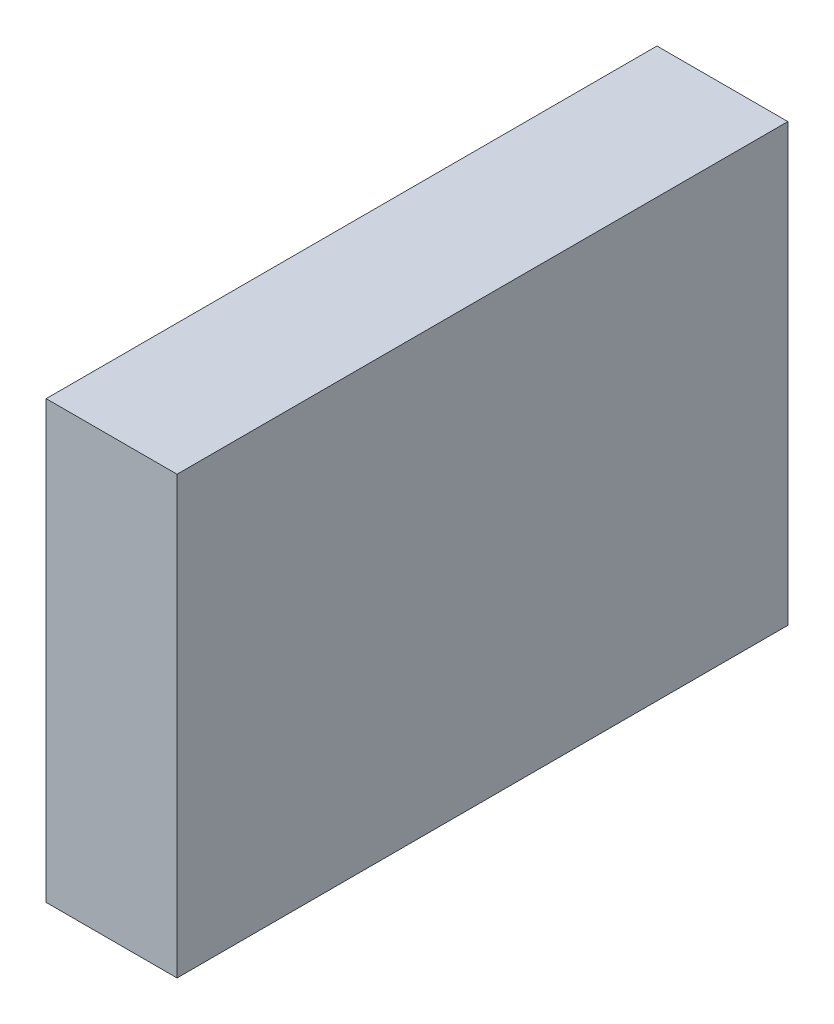
ISO-10303-21;
HEADER;
FILE_DESCRIPTION(('STEP AP214'),'2;1');
FILE_NAME('part.step','',(''),(''),'','','');
FILE_SCHEMA(('AUTOMOTIVE_DESIGN { 1 0 10303 214 1 1 1 1 }'));
ENDSEC;
DATA;
#1=APPLICATION_CONTEXT('core data for automotive mechanical design processes');
#2=APPLICATION_PROTOCOL_DEFINITION('international standard','automotive_design',2000,#1);
#3=PRODUCT_CONTEXT('',#1,'mechanical');
#4=PRODUCT('Part','Part','',(#3));
#5=PRODUCT_RELATED_PRODUCT_CATEGORY('part','',(#4));
#6=PRODUCT_DEFINITION_FORMATION('','',#4);
#7=PRODUCT_DEFINITION_CONTEXT('part definition',#1,'design');
#8=PRODUCT_DEFINITION('design','',#6,#7);
#9=PRODUCT_DEFINITION_SHAPE('','',#8);
#10=(LENGTH_UNIT() NAMED_UNIT(*) SI_UNIT(.MILLI.,.METRE.));
#11=(NAMED_UNIT(*) PLANE_ANGLE_UNIT() SI_UNIT($,.RADIAN.));
#12=(NAMED_UNIT(*) SI_UNIT($,.STERADIAN.) SOLID_ANGLE_UNIT());
#13=UNCERTAINTY_MEASURE_WITH_UNIT(LENGTH_MEASURE(1.E-05),#10,'distance_accuracy_value','');
#14=(GEOMETRIC_REPRESENTATION_CONTEXT(3) GLOBAL_UNCERTAINTY_ASSIGNED_CONTEXT((#13)) GLOBAL_UNIT_ASSIGNED_CONTEXT((#10,
#11,#12)) REPRESENTATION_CONTEXT('',''));
#15=CARTESIAN_POINT('',(0.,0.,0.));
#16=DIRECTION('',(0.,0.,1.));
#17=DIRECTION('',(1.,0.,0.));
#18=AXIS2_PLACEMENT_3D('',#15,#16,#17);
#19=CARTESIAN_POINT('',(3.00000011889495,0.679999297994104,-3.72112146154861));
#20=DIRECTION('',(1.,-1.74845553146952E-07,0.));
#21=DIRECTION('',(1.74845553146952E-07,1.,8.74227765734759E-08));
#22=AXIS2_PLACEMENT_3D('',#19,#20,#21);
#23=PLANE('',#22);
#24=DIRECTION('',(0.,8.74227765576152E-08,-0.999999999999996));
#25=VECTOR('',#24,1.);
#26=CARTESIAN_POINT('',(3.00000013113411,0.749999169481623,-2.25112145542901));
#27=LINE('',#26,#25);
#28=CARTESIAN_POINT('',(3.00000013113411,0.749999169481623,-2.25112145543001));
#29=VERTEX_POINT('',#28);
#30=CARTESIAN_POINT('',(3.00000013113413,0.74999929187451,-3.65112145542901));
#31=VERTEX_POINT('',#30);
#32=EDGE_CURVE('E11',#29,#31,#27,.T.);
#33=ORIENTED_EDGE('',*,*,#32,.F.);
#34=DIRECTION('',(-1.74845553146599E-07,-0.999999999999981,-8.74227765732993E-08));
#35=VECTOR('',#34,1.);
#36=CARTESIAN_POINT('',(3.00000030597966,1.74999916948362,-2.25112136800623));
#37=LINE('',#36,#35);
#38=CARTESIAN_POINT('',(3.00000030597966,1.74999916948262,-2.25112136800623));
#39=VERTEX_POINT('',#38);
#40=EDGE_CURVE('E59',#39,#29,#37,.T.);
#41=ORIENTED_EDGE('',*,*,#40,.F.);
#42=DIRECTION('',(0.,-8.74227766369168E-08,0.999999999999996));
#43=VECTOR('',#42,1.);
#44=CARTESIAN_POINT('',(3.00000030597969,1.74999929187551,-3.65112136800624));
#45=LINE('',#44,#43);
#46=CARTESIAN_POINT('',(3.00000030597969,1.74999929187551,-3.65112136800523));
#47=VERTEX_POINT('',#46);
#48=EDGE_CURVE('E79',#47,#39,#45,.T.);
#49=ORIENTED_EDGE('',*,*,#48,.F.);
#50=DIRECTION('',(1.74845553146599E-07,0.999999999999981,8.74227765732994E-08));
#51=VECTOR('',#50,1.);
#52=CARTESIAN_POINT('',(3.00000013113413,0.74999929187351,-3.65112145542901));
#53=LINE('',#52,#51);
#54=EDGE_CURVE('E84',#31,#47,#53,.T.);
#55=ORIENTED_EDGE('',*,*,#54,.F.);
#56=EDGE_LOOP('',(#33,#41,#49,#55));
#57=FACE_BOUND('',#56,.T.);
#58=ADVANCED_FACE('F17',(#57),#23,.F.);
#59=CARTESIAN_POINT('',(3.30000011889495,0.679999245540438,-3.72112146154861));
#60=DIRECTION('',(1.,-1.74845553146952E-07,0.));
#61=DIRECTION('',(1.74845553146952E-07,1.,8.74227765734759E-08));
#62=AXIS2_PLACEMENT_3D('',#59,#60,#61);
#63=PLANE('',#62);
#64=DIRECTION('',(1.74845553146599E-07,0.999999999999981,8.74227765732994E-08));
#65=VECTOR('',#64,1.);
#66=CARTESIAN_POINT('',(3.30000013113413,0.749999239419844,-3.65112145542901));
#67=LINE('',#66,#65);
#68=CARTESIAN_POINT('',(3.30000013113413,0.749999239420844,-3.65112145542901));
#69=VERTEX_POINT('',#68);
#70=CARTESIAN_POINT('',(3.30000030597969,1.74999923942184,-3.65112136800523));
#71=VERTEX_POINT('',#70);
#72=EDGE_CURVE('E24',#69,#71,#67,.T.);
#73=ORIENTED_EDGE('',*,*,#72,.T.);
#74=DIRECTION('',(0.,-8.74227764783136E-08,0.999999999999996));
#75=VECTOR('',#74,1.);
#76=CARTESIAN_POINT('',(3.30000030597969,1.74999923942184,-3.65112136800623));
#77=LINE('',#76,#75);
#78=CARTESIAN_POINT('',(3.30000030597966,1.74999911702896,-2.25112136800623));
#79=VERTEX_POINT('',#78);
#80=EDGE_CURVE('E82',#71,#79,#77,.T.);
#81=ORIENTED_EDGE('',*,*,#80,.T.);
#82=DIRECTION('',(-1.74845553146599E-07,-0.999999999999981,-8.74227765732993E-08));
#83=VECTOR('',#82,1.);
#84=CARTESIAN_POINT('',(3.30000030597966,1.74999911702996,-2.25112136800623));
#85=LINE('',#84,#83);
#86=CARTESIAN_POINT('',(3.30000013113411,0.749999117027957,-2.25112145543001));
#87=VERTEX_POINT('',#86);
#88=EDGE_CURVE('E64',#79,#87,#85,.T.);
#89=ORIENTED_EDGE('',*,*,#88,.T.);
#90=DIRECTION('',(0.,8.74227765576152E-08,-0.999999999999996));
#91=VECTOR('',#90,1.);
#92=CARTESIAN_POINT('',(3.30000013113411,0.749999117027957,-2.25112145542901));
#93=LINE('',#92,#91);
#94=EDGE_CURVE('E61',#87,#69,#93,.T.);
#95=ORIENTED_EDGE('',*,*,#94,.T.);
#96=EDGE_LOOP('',(#73,#81,#89,#95));
#97=FACE_BOUND('',#96,.T.);
#98=ADVANCED_FACE('F62',(#97),#63,.T.);
#99=CARTESIAN_POINT('',(3.00000013113413,0.74999929187351,-3.65112145542901));
#100=DIRECTION('',(0.,8.74227765734759E-08,-1.));
#101=DIRECTION('',(1.74845553146952E-07,1.,8.74227765734759E-08));
#102=AXIS2_PLACEMENT_3D('',#99,#100,#101);
#103=PLANE('',#102);
#104=ORIENTED_EDGE('',*,*,#54,.T.);
#105=DIRECTION('',(0.999999999999985,-1.7484555285089E-07,0.));
#106=VECTOR('',#105,1.);
#107=CARTESIAN_POINT('',(3.00000030597969,1.74999929187551,-3.65112136800623));
#108=LINE('',#107,#106);
#109=EDGE_CURVE('E57',#47,#71,#108,.T.);
#110=ORIENTED_EDGE('',*,*,#109,.T.);
#111=ORIENTED_EDGE('',*,*,#72,.F.);
#112=DIRECTION('',(0.999999999999985,-1.74845553220964E-07,0.));
#113=VECTOR('',#112,1.);
#114=CARTESIAN_POINT('',(3.00000013113413,0.74999929187351,-3.65112145542901));
#115=LINE('',#114,#113);
#116=EDGE_CURVE('E55',#31,#69,#115,.T.);
#117=ORIENTED_EDGE('',*,*,#116,.F.);
#118=EDGE_LOOP('',(#104,#110,#111,#117));
#119=FACE_BOUND('',#118,.T.);
#120=ADVANCED_FACE('F53',(#119),#103,.T.);
#121=CARTESIAN_POINT('',(3.00000030597969,1.74999929187551,-3.65112136800623));
#122=DIRECTION('',(1.74845553146952E-07,1.,8.74227765734759E-08));
#123=DIRECTION('',(0.,-8.74227765734759E-08,1.));
#124=AXIS2_PLACEMENT_3D('',#121,#122,#123);
#125=PLANE('',#124);
#126=ORIENTED_EDGE('',*,*,#48,.T.);
#127=DIRECTION('',(0.999999999999985,-1.7484555285089E-07,0.));
#128=VECTOR('',#127,1.);
#129=CARTESIAN_POINT('',(3.00000030597966,1.74999916948362,-2.25112136800623));
#130=LINE('',#129,#128);
#131=EDGE_CURVE('E68',#39,#79,#130,.T.);
#132=ORIENTED_EDGE('',*,*,#131,.T.);
#133=ORIENTED_EDGE('',*,*,#80,.F.);
#134=ORIENTED_EDGE('',*,*,#109,.F.);
#135=EDGE_LOOP('',(#126,#132,#133,#134));
#136=FACE_BOUND('',#135,.T.);
#137=ADVANCED_FACE('F91',(#136),#125,.T.);
#138=CARTESIAN_POINT('',(3.00000030597966,1.74999916948362,-2.25112136800623));
#139=DIRECTION('',(0.,-8.74227765734759E-08,1.));
#140=DIRECTION('',(-1.74845553146952E-07,-1.,-8.74227765734759E-08));
#141=AXIS2_PLACEMENT_3D('',#138,#139,#140);
#142=PLANE('',#141);
#143=ORIENTED_EDGE('',*,*,#40,.T.);
#144=DIRECTION('',(0.999999999999985,-1.74845553220964E-07,0.));
#145=VECTOR('',#144,1.);
#146=CARTESIAN_POINT('',(3.00000013113411,0.749999169481622,-2.25112145542901));
#147=LINE('',#146,#145);
#148=EDGE_CURVE('E69',#29,#87,#147,.T.);
#149=ORIENTED_EDGE('',*,*,#148,.T.);
#150=ORIENTED_EDGE('',*,*,#88,.F.);
#151=ORIENTED_EDGE('',*,*,#131,.F.);
#152=EDGE_LOOP('',(#143,#149,#150,#151));
#153=FACE_BOUND('',#152,.T.);
#154=ADVANCED_FACE('F88',(#153),#142,.T.);
#155=CARTESIAN_POINT('',(3.00000013113411,0.749999169481623,-2.25112145542901));
#156=DIRECTION('',(-1.74845553146952E-07,-1.,-8.74227765734759E-08));
#157=DIRECTION('',(0.,8.74227765734759E-08,-1.));
#158=AXIS2_PLACEMENT_3D('',#155,#156,#157);
#159=PLANE('',#158);
#160=ORIENTED_EDGE('',*,*,#32,.T.);
#161=ORIENTED_EDGE('',*,*,#116,.T.);
#162=ORIENTED_EDGE('',*,*,#94,.F.);
#163=ORIENTED_EDGE('',*,*,#148,.F.);
#164=EDGE_LOOP('',(#160,#161,#162,#163));
#165=FACE_BOUND('',#164,.T.);
#166=ADVANCED_FACE('F71',(#165),#159,.T.);
#167=CLOSED_SHELL('',(#58,#98,#120,#137,#154,#166));
#168=MANIFOLD_SOLID_BREP('B1',#167);
#169=ADVANCED_BREP_SHAPE_REPRESENTATION('',(#18,#168),#14);
#170=SHAPE_DEFINITION_REPRESENTATION(#9,#169);
ENDSEC;
END-ISO-10303-21;
